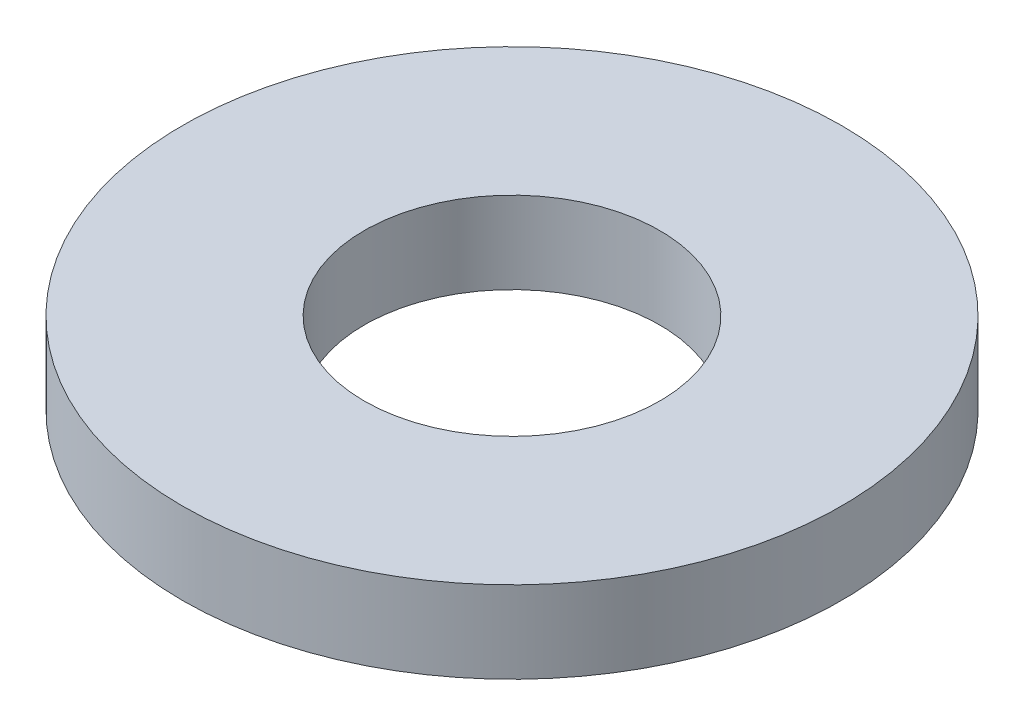
ISO-10303-21;
HEADER;
FILE_DESCRIPTION(('STEP AP214'),'2;1');
FILE_NAME('part.step','',(''),(''),'','','');
FILE_SCHEMA(('AUTOMOTIVE_DESIGN { 1 0 10303 214 1 1 1 1 }'));
ENDSEC;
DATA;
#1=APPLICATION_CONTEXT('core data for automotive mechanical design processes');
#2=APPLICATION_PROTOCOL_DEFINITION('international standard','automotive_design',2000,#1);
#3=PRODUCT_CONTEXT('',#1,'mechanical');
#4=PRODUCT('Part','Part','',(#3));
#5=PRODUCT_RELATED_PRODUCT_CATEGORY('part','',(#4));
#6=PRODUCT_DEFINITION_FORMATION('','',#4);
#7=PRODUCT_DEFINITION_CONTEXT('part definition',#1,'design');
#8=PRODUCT_DEFINITION('design','',#6,#7);
#9=PRODUCT_DEFINITION_SHAPE('','',#8);
#10=(LENGTH_UNIT() NAMED_UNIT(*) SI_UNIT(.MILLI.,.METRE.));
#11=(NAMED_UNIT(*) PLANE_ANGLE_UNIT() SI_UNIT($,.RADIAN.));
#12=(NAMED_UNIT(*) SI_UNIT($,.STERADIAN.) SOLID_ANGLE_UNIT());
#13=UNCERTAINTY_MEASURE_WITH_UNIT(LENGTH_MEASURE(1.E-05),#10,'distance_accuracy_value','');
#14=(GEOMETRIC_REPRESENTATION_CONTEXT(3) GLOBAL_UNCERTAINTY_ASSIGNED_CONTEXT((#13)) GLOBAL_UNIT_ASSIGNED_CONTEXT((#10,
#11,#12)) REPRESENTATION_CONTEXT('',''));
#15=CARTESIAN_POINT('',(0.,0.,0.));
#16=DIRECTION('',(0.,0.,1.));
#17=DIRECTION('',(1.,0.,0.));
#18=AXIS2_PLACEMENT_3D('',#15,#16,#17);
#19=CARTESIAN_POINT('',(0.,18.,0.));
#20=DIRECTION('',(0.,-1.,0.));
#21=DIRECTION('',(0.,0.,-1.));
#22=AXIS2_PLACEMENT_3D('',#19,#20,#21);
#23=CYLINDRICAL_SURFACE('',#22,72.5);
#24=CARTESIAN_POINT('',(0.,18.,0.));
#25=DIRECTION('',(0.,1.,0.));
#26=DIRECTION('',(0.,0.,1.));
#27=AXIS2_PLACEMENT_3D('',#24,#25,#26);
#28=CIRCLE('',#27,72.5);
#29=CARTESIAN_POINT('',(0.,18.,72.5));
#30=VERTEX_POINT('',#29);
#31=EDGE_CURVE('E10',#30,#30,#28,.T.);
#32=ORIENTED_EDGE('',*,*,#31,.F.);
#33=EDGE_LOOP('',(#32));
#34=FACE_BOUND('',#33,.T.);
#35=CARTESIAN_POINT('',(0.,0.,0.));
#36=DIRECTION('',(0.,1.,0.));
#37=DIRECTION('',(0.,0.,1.));
#38=AXIS2_PLACEMENT_3D('',#35,#36,#37);
#39=CIRCLE('',#38,72.5);
#40=CARTESIAN_POINT('',(0.,0.,72.5));
#41=VERTEX_POINT('',#40);
#42=EDGE_CURVE('E37',#41,#41,#39,.T.);
#43=ORIENTED_EDGE('',*,*,#42,.T.);
#44=EDGE_LOOP('',(#43));
#45=FACE_BOUND('',#44,.T.);
#46=ADVANCED_FACE('F40',(#34,#45),#23,.T.);
#47=CARTESIAN_POINT('',(0.,18.,0.));
#48=DIRECTION('',(0.,1.,0.));
#49=DIRECTION('',(0.,0.,1.));
#50=AXIS2_PLACEMENT_3D('',#47,#48,#49);
#51=PLANE('',#50);
#52=CARTESIAN_POINT('',(0.,18.,0.));
#53=DIRECTION('',(0.,1.,0.));
#54=DIRECTION('',(0.,0.,1.));
#55=AXIS2_PLACEMENT_3D('',#52,#53,#54);
#56=CIRCLE('',#55,32.5);
#57=CARTESIAN_POINT('',(0.,18.,32.5));
#58=VERTEX_POINT('',#57);
#59=EDGE_CURVE('E50',#58,#58,#56,.T.);
#60=ORIENTED_EDGE('',*,*,#59,.F.);
#61=EDGE_LOOP('',(#60));
#62=FACE_BOUND('',#61,.T.);
#63=ORIENTED_EDGE('',*,*,#31,.T.);
#64=EDGE_LOOP('',(#63));
#65=FACE_BOUND('',#64,.T.);
#66=ADVANCED_FACE('F59',(#62,#65),#51,.T.);
#67=CARTESIAN_POINT('',(0.,0.,0.));
#68=DIRECTION('',(0.,1.,0.));
#69=DIRECTION('',(0.,0.,1.));
#70=AXIS2_PLACEMENT_3D('',#67,#68,#69);
#71=PLANE('',#70);
#72=CARTESIAN_POINT('',(0.,0.,0.));
#73=DIRECTION('',(0.,1.,0.));
#74=DIRECTION('',(0.,0.,1.));
#75=AXIS2_PLACEMENT_3D('',#72,#73,#74);
#76=CIRCLE('',#75,32.5);
#77=CARTESIAN_POINT('',(0.,0.,32.5));
#78=VERTEX_POINT('',#77);
#79=EDGE_CURVE('E47',#78,#78,#76,.T.);
#80=ORIENTED_EDGE('',*,*,#79,.T.);
#81=EDGE_LOOP('',(#80));
#82=FACE_BOUND('',#81,.T.);
#83=ORIENTED_EDGE('',*,*,#42,.F.);
#84=EDGE_LOOP('',(#83));
#85=FACE_BOUND('',#84,.T.);
#86=ADVANCED_FACE('F58',(#82,#85),#71,.F.);
#87=CARTESIAN_POINT('',(0.,18.,0.));
#88=DIRECTION('',(0.,-1.,0.));
#89=DIRECTION('',(0.,0.,-1.));
#90=AXIS2_PLACEMENT_3D('',#87,#88,#89);
#91=CYLINDRICAL_SURFACE('',#90,32.5);
#92=ORIENTED_EDGE('',*,*,#59,.T.);
#93=EDGE_LOOP('',(#92));
#94=FACE_BOUND('',#93,.T.);
#95=ORIENTED_EDGE('',*,*,#79,.F.);
#96=EDGE_LOOP('',(#95));
#97=FACE_BOUND('',#96,.T.);
#98=ADVANCED_FACE('F54',(#94,#97),#91,.F.);
#99=CLOSED_SHELL('',(#46,#66,#86,#98));
#100=MANIFOLD_SOLID_BREP('B2',#99);
#101=ADVANCED_BREP_SHAPE_REPRESENTATION('',(#18,#100),#14);
#102=SHAPE_DEFINITION_REPRESENTATION(#9,#101);
ENDSEC;
END-ISO-10303-21;
